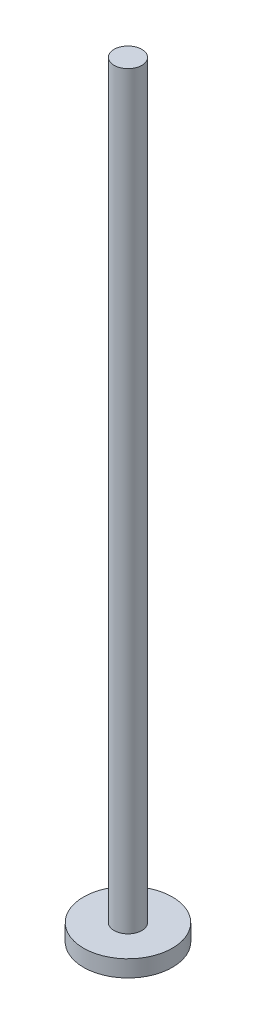
ISO-10303-21;
HEADER;
FILE_DESCRIPTION(('STEP AP214'),'2;1');
FILE_NAME('part.step','',(''),(''),'','','');
FILE_SCHEMA(('AUTOMOTIVE_DESIGN { 1 0 10303 214 1 1 1 1 }'));
ENDSEC;
DATA;
#1=APPLICATION_CONTEXT('core data for automotive mechanical design processes');
#2=APPLICATION_PROTOCOL_DEFINITION('international standard','automotive_design',2000,#1);
#3=PRODUCT_CONTEXT('',#1,'mechanical');
#4=PRODUCT('Part','Part','',(#3));
#5=PRODUCT_RELATED_PRODUCT_CATEGORY('part','',(#4));
#6=PRODUCT_DEFINITION_FORMATION('','',#4);
#7=PRODUCT_DEFINITION_CONTEXT('part definition',#1,'design');
#8=PRODUCT_DEFINITION('design','',#6,#7);
#9=PRODUCT_DEFINITION_SHAPE('','',#8);
#10=(LENGTH_UNIT() NAMED_UNIT(*) SI_UNIT(.MILLI.,.METRE.));
#11=(NAMED_UNIT(*) PLANE_ANGLE_UNIT() SI_UNIT($,.RADIAN.));
#12=(NAMED_UNIT(*) SI_UNIT($,.STERADIAN.) SOLID_ANGLE_UNIT());
#13=UNCERTAINTY_MEASURE_WITH_UNIT(LENGTH_MEASURE(1.E-05),#10,'distance_accuracy_value','');
#14=(GEOMETRIC_REPRESENTATION_CONTEXT(3) GLOBAL_UNCERTAINTY_ASSIGNED_CONTEXT((#13)) GLOBAL_UNIT_ASSIGNED_CONTEXT((#10,
#11,#12)) REPRESENTATION_CONTEXT('',''));
#15=CARTESIAN_POINT('',(0.,0.,0.));
#16=DIRECTION('',(0.,0.,1.));
#17=DIRECTION('',(1.,0.,0.));
#18=AXIS2_PLACEMENT_3D('',#15,#16,#17);
#19=CARTESIAN_POINT('',(0.,3.,0.));
#20=DIRECTION('',(0.,-1.,0.));
#21=DIRECTION('',(0.,0.,-1.));
#22=AXIS2_PLACEMENT_3D('',#19,#20,#21);
#23=CYLINDRICAL_SURFACE('',#22,8.);
#24=CARTESIAN_POINT('',(0.,3.,0.));
#25=DIRECTION('',(0.,1.,0.));
#26=DIRECTION('',(0.,0.,1.));
#27=AXIS2_PLACEMENT_3D('',#24,#25,#26);
#28=CIRCLE('',#27,8.);
#29=CARTESIAN_POINT('',(0.,3.,8.));
#30=VERTEX_POINT('',#29);
#31=EDGE_CURVE('E10',#30,#30,#28,.T.);
#32=ORIENTED_EDGE('',*,*,#31,.F.);
#33=EDGE_LOOP('',(#32));
#34=FACE_BOUND('',#33,.T.);
#35=CARTESIAN_POINT('',(0.,0.,0.));
#36=DIRECTION('',(0.,1.,0.));
#37=DIRECTION('',(0.,0.,1.));
#38=AXIS2_PLACEMENT_3D('',#35,#36,#37);
#39=CIRCLE('',#38,8.);
#40=CARTESIAN_POINT('',(0.,0.,8.));
#41=VERTEX_POINT('',#40);
#42=EDGE_CURVE('E35',#41,#41,#39,.T.);
#43=ORIENTED_EDGE('',*,*,#42,.T.);
#44=EDGE_LOOP('',(#43));
#45=FACE_BOUND('',#44,.T.);
#46=ADVANCED_FACE('F32',(#34,#45),#23,.T.);
#47=CARTESIAN_POINT('',(0.,3.,0.));
#48=DIRECTION('',(0.,1.,0.));
#49=DIRECTION('',(0.,0.,1.));
#50=AXIS2_PLACEMENT_3D('',#47,#48,#49);
#51=PLANE('',#50);
#52=CARTESIAN_POINT('',(0.,3.,0.));
#53=DIRECTION('',(0.,1.,0.));
#54=DIRECTION('',(0.,0.,1.));
#55=AXIS2_PLACEMENT_3D('',#52,#53,#54);
#56=CIRCLE('',#55,2.5);
#57=CARTESIAN_POINT('',(0.,3.,2.5));
#58=VERTEX_POINT('',#57);
#59=EDGE_CURVE('E44',#58,#58,#56,.T.);
#60=ORIENTED_EDGE('',*,*,#59,.F.);
#61=EDGE_LOOP('',(#60));
#62=FACE_BOUND('',#61,.T.);
#63=ORIENTED_EDGE('',*,*,#31,.T.);
#64=EDGE_LOOP('',(#63));
#65=FACE_BOUND('',#64,.T.);
#66=ADVANCED_FACE('F59',(#62,#65),#51,.T.);
#67=CARTESIAN_POINT('',(0.,0.,0.));
#68=DIRECTION('',(0.,1.,0.));
#69=DIRECTION('',(0.,0.,1.));
#70=AXIS2_PLACEMENT_3D('',#67,#68,#69);
#71=PLANE('',#70);
#72=ORIENTED_EDGE('',*,*,#42,.F.);
#73=EDGE_LOOP('',(#72));
#74=FACE_BOUND('',#73,.T.);
#75=ADVANCED_FACE('F55',(#74),#71,.F.);
#76=CARTESIAN_POINT('',(0.,138.,0.));
#77=DIRECTION('',(0.,-1.,0.));
#78=DIRECTION('',(0.,0.,-1.));
#79=AXIS2_PLACEMENT_3D('',#76,#77,#78);
#80=CYLINDRICAL_SURFACE('',#79,2.5);
#81=CARTESIAN_POINT('',(0.,138.,0.));
#82=DIRECTION('',(0.,1.,0.));
#83=DIRECTION('',(0.,0.,1.));
#84=AXIS2_PLACEMENT_3D('',#81,#82,#83);
#85=CIRCLE('',#84,2.5);
#86=CARTESIAN_POINT('',(0.,138.,2.5));
#87=VERTEX_POINT('',#86);
#88=EDGE_CURVE('E42',#87,#87,#85,.T.);
#89=ORIENTED_EDGE('',*,*,#88,.F.);
#90=EDGE_LOOP('',(#89));
#91=FACE_BOUND('',#90,.T.);
#92=ORIENTED_EDGE('',*,*,#59,.T.);
#93=EDGE_LOOP('',(#92));
#94=FACE_BOUND('',#93,.T.);
#95=ADVANCED_FACE('F52',(#91,#94),#80,.T.);
#96=CARTESIAN_POINT('',(0.,138.,0.));
#97=DIRECTION('',(0.,1.,0.));
#98=DIRECTION('',(0.,0.,1.));
#99=AXIS2_PLACEMENT_3D('',#96,#97,#98);
#100=PLANE('',#99);
#101=ORIENTED_EDGE('',*,*,#88,.T.);
#102=EDGE_LOOP('',(#101));
#103=FACE_BOUND('',#102,.T.);
#104=ADVANCED_FACE('F50',(#103),#100,.T.);
#105=CLOSED_SHELL('',(#46,#66,#75,#95,#104));
#106=MANIFOLD_SOLID_BREP('B2',#105);
#107=ADVANCED_BREP_SHAPE_REPRESENTATION('',(#18,#106),#14);
#108=SHAPE_DEFINITION_REPRESENTATION(#9,#107);
ENDSEC;
END-ISO-10303-21;
